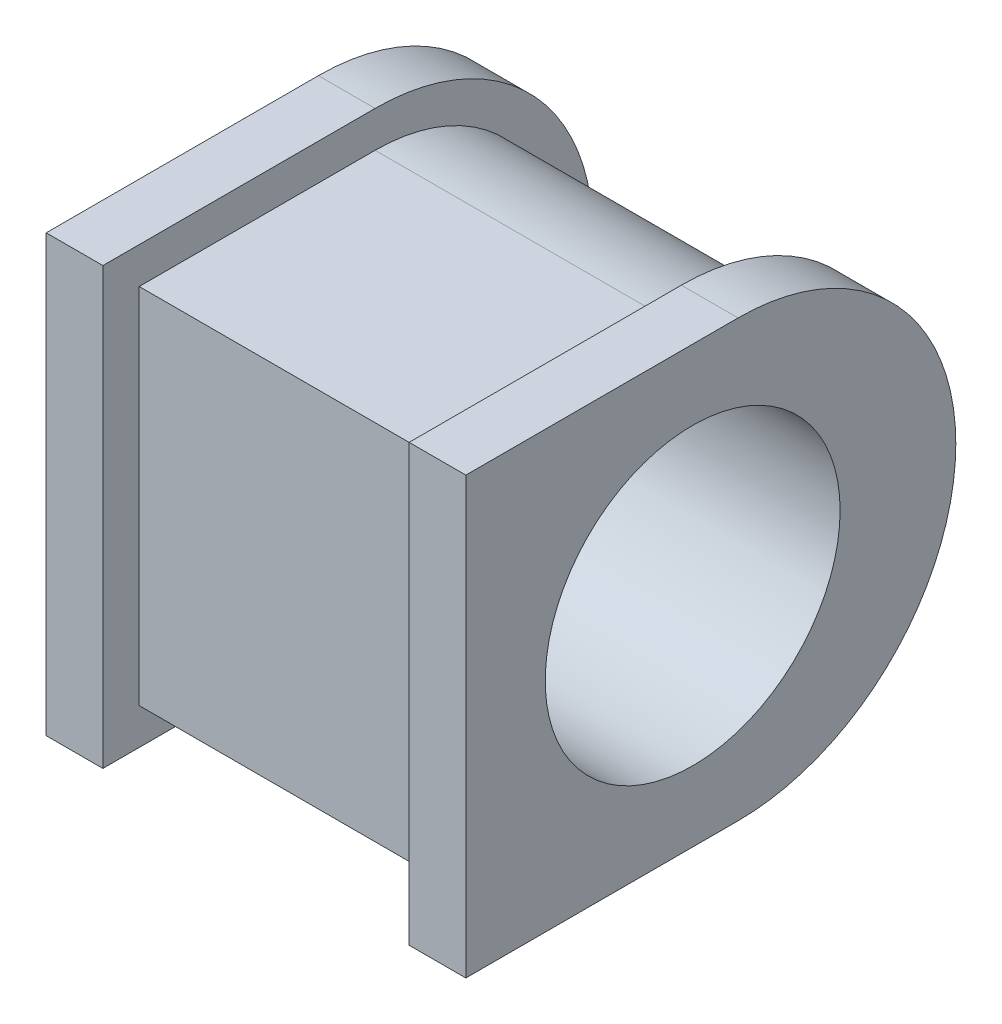
ISO-10303-21;
HEADER;
FILE_DESCRIPTION(('STEP AP214'),'2;1');
FILE_NAME('part.step','',(''),(''),'','','');
FILE_SCHEMA(('AUTOMOTIVE_DESIGN { 1 0 10303 214 1 1 1 1 }'));
ENDSEC;
DATA;
#1=APPLICATION_CONTEXT('core data for automotive mechanical design processes');
#2=APPLICATION_PROTOCOL_DEFINITION('international standard','automotive_design',2000,#1);
#3=PRODUCT_CONTEXT('',#1,'mechanical');
#4=PRODUCT('Part','Part','',(#3));
#5=PRODUCT_RELATED_PRODUCT_CATEGORY('part','',(#4));
#6=PRODUCT_DEFINITION_FORMATION('','',#4);
#7=PRODUCT_DEFINITION_CONTEXT('part definition',#1,'design');
#8=PRODUCT_DEFINITION('design','',#6,#7);
#9=PRODUCT_DEFINITION_SHAPE('','',#8);
#10=(LENGTH_UNIT() NAMED_UNIT(*) SI_UNIT(.MILLI.,.METRE.));
#11=(NAMED_UNIT(*) PLANE_ANGLE_UNIT() SI_UNIT($,.RADIAN.));
#12=(NAMED_UNIT(*) SI_UNIT($,.STERADIAN.) SOLID_ANGLE_UNIT());
#13=UNCERTAINTY_MEASURE_WITH_UNIT(LENGTH_MEASURE(1.E-05),#10,'distance_accuracy_value','');
#14=(GEOMETRIC_REPRESENTATION_CONTEXT(3) GLOBAL_UNCERTAINTY_ASSIGNED_CONTEXT((#13)) GLOBAL_UNIT_ASSIGNED_CONTEXT((#10,
#11,#12)) REPRESENTATION_CONTEXT('',''));
#15=CARTESIAN_POINT('',(0.,0.,0.));
#16=DIRECTION('',(0.,0.,1.));
#17=DIRECTION('',(1.,0.,0.));
#18=AXIS2_PLACEMENT_3D('',#15,#16,#17);
#19=CARTESIAN_POINT('',(80.,0.,0.));
#20=DIRECTION('',(0.,0.,-1.));
#21=DIRECTION('',(-1.,0.,0.));
#22=AXIS2_PLACEMENT_3D('',#19,#20,#21);
#23=PLANE('',#22);
#24=DIRECTION('',(0.,1.,0.));
#25=VECTOR('',#24,1.);
#26=CARTESIAN_POINT('',(12.5,0.,0.));
#27=LINE('',#26,#25);
#28=CARTESIAN_POINT('',(12.5,0.,0.));
#29=VERTEX_POINT('',#28);
#30=CARTESIAN_POINT('',(12.5,80.,0.));
#31=VERTEX_POINT('',#30);
#32=EDGE_CURVE('E51',#29,#31,#27,.T.);
#33=ORIENTED_EDGE('',*,*,#32,.F.);
#34=DIRECTION('',(-1.,0.,0.));
#35=VECTOR('',#34,1.);
#36=CARTESIAN_POINT('',(80.,0.,0.));
#37=LINE('',#36,#35);
#38=CARTESIAN_POINT('',(80.,0.,0.));
#39=VERTEX_POINT('',#38);
#40=EDGE_CURVE('E44',#39,#29,#37,.T.);
#41=ORIENTED_EDGE('',*,*,#40,.F.);
#42=DIRECTION('',(0.,-1.,0.));
#43=VECTOR('',#42,1.);
#44=CARTESIAN_POINT('',(80.,0.,0.));
#45=LINE('',#44,#43);
#46=CARTESIAN_POINT('',(80.,80.,0.));
#47=VERTEX_POINT('',#46);
#48=EDGE_CURVE('E206',#47,#39,#45,.T.);
#49=ORIENTED_EDGE('',*,*,#48,.F.);
#50=DIRECTION('',(-1.,0.,0.));
#51=VECTOR('',#50,1.);
#52=CARTESIAN_POINT('',(80.,80.,0.));
#53=LINE('',#52,#51);
#54=EDGE_CURVE('E218',#47,#31,#53,.T.);
#55=ORIENTED_EDGE('',*,*,#54,.T.);
#56=EDGE_LOOP('',(#33,#41,#49,#55));
#57=FACE_BOUND('',#56,.T.);
#58=ADVANCED_FACE('F37',(#57),#23,.F.);
#59=CARTESIAN_POINT('',(80.,0.,0.));
#60=DIRECTION('',(0.,1.,0.));
#61=DIRECTION('',(0.,0.,1.));
#62=AXIS2_PLACEMENT_3D('',#59,#60,#61);
#63=PLANE('',#62);
#64=DIRECTION('',(0.,0.,1.));
#65=VECTOR('',#64,1.);
#66=CARTESIAN_POINT('',(12.5,0.,0.));
#67=LINE('',#66,#65);
#68=CARTESIAN_POINT('',(12.5,0.,-52.));
#69=VERTEX_POINT('',#68);
#70=EDGE_CURVE('E58',#69,#29,#67,.T.);
#71=ORIENTED_EDGE('',*,*,#70,.F.);
#72=DIRECTION('',(-1.,0.,0.));
#73=VECTOR('',#72,1.);
#74=CARTESIAN_POINT('',(80.,0.,-52.));
#75=LINE('',#74,#73);
#76=CARTESIAN_POINT('',(80.,0.,-52.));
#77=VERTEX_POINT('',#76);
#78=EDGE_CURVE('E222',#77,#69,#75,.T.);
#79=ORIENTED_EDGE('',*,*,#78,.F.);
#80=DIRECTION('',(0.,0.,-1.));
#81=VECTOR('',#80,1.);
#82=CARTESIAN_POINT('',(80.,0.,0.));
#83=LINE('',#82,#81);
#84=EDGE_CURVE('E209',#39,#77,#83,.T.);
#85=ORIENTED_EDGE('',*,*,#84,.F.);
#86=ORIENTED_EDGE('',*,*,#40,.T.);
#87=EDGE_LOOP('',(#71,#79,#85,#86));
#88=FACE_BOUND('',#87,.T.);
#89=ADVANCED_FACE('F223',(#88),#63,.F.);
#90=CARTESIAN_POINT('',(80.,40.,-52.));
#91=DIRECTION('',(-1.,0.,0.));
#92=DIRECTION('',(0.,0.,1.));
#93=AXIS2_PLACEMENT_3D('',#90,#91,#92);
#94=CYLINDRICAL_SURFACE('',#93,40.);
#95=CARTESIAN_POINT('',(12.5,40.,-52.));
#96=DIRECTION('',(-1.,0.,0.));
#97=DIRECTION('',(0.,0.,1.));
#98=AXIS2_PLACEMENT_3D('',#95,#96,#97);
#99=CIRCLE('',#98,40.);
#100=CARTESIAN_POINT('',(12.5,80.,-52.));
#101=VERTEX_POINT('',#100);
#102=EDGE_CURVE('E138',#101,#69,#99,.T.);
#103=ORIENTED_EDGE('',*,*,#102,.F.);
#104=DIRECTION('',(-1.,0.,0.));
#105=VECTOR('',#104,1.);
#106=CARTESIAN_POINT('',(80.,80.,-52.));
#107=LINE('',#106,#105);
#108=CARTESIAN_POINT('',(80.,80.,-52.));
#109=VERTEX_POINT('',#108);
#110=EDGE_CURVE('E220',#109,#101,#107,.T.);
#111=ORIENTED_EDGE('',*,*,#110,.F.);
#112=CARTESIAN_POINT('',(80.,40.,-52.));
#113=DIRECTION('',(1.,0.,0.));
#114=DIRECTION('',(0.,0.,-1.));
#115=AXIS2_PLACEMENT_3D('',#112,#113,#114);
#116=CIRCLE('',#115,40.);
#117=EDGE_CURVE('E212',#77,#109,#116,.T.);
#118=ORIENTED_EDGE('',*,*,#117,.F.);
#119=ORIENTED_EDGE('',*,*,#78,.T.);
#120=EDGE_LOOP('',(#103,#111,#118,#119));
#121=FACE_BOUND('',#120,.T.);
#122=ADVANCED_FACE('F228',(#121),#94,.T.);
#123=CARTESIAN_POINT('',(80.,80.,0.));
#124=DIRECTION('',(0.,-1.,0.));
#125=DIRECTION('',(0.,0.,-1.));
#126=AXIS2_PLACEMENT_3D('',#123,#124,#125);
#127=PLANE('',#126);
#128=DIRECTION('',(0.,0.,-1.));
#129=VECTOR('',#128,1.);
#130=CARTESIAN_POINT('',(12.5,80.,0.));
#131=LINE('',#130,#129);
#132=EDGE_CURVE('E11',#31,#101,#131,.T.);
#133=ORIENTED_EDGE('',*,*,#132,.F.);
#134=ORIENTED_EDGE('',*,*,#54,.F.);
#135=DIRECTION('',(0.,0.,1.));
#136=VECTOR('',#135,1.);
#137=CARTESIAN_POINT('',(80.,80.,0.));
#138=LINE('',#137,#136);
#139=EDGE_CURVE('E215',#109,#47,#138,.T.);
#140=ORIENTED_EDGE('',*,*,#139,.F.);
#141=ORIENTED_EDGE('',*,*,#110,.T.);
#142=EDGE_LOOP('',(#133,#134,#140,#141));
#143=FACE_BOUND('',#142,.T.);
#144=ADVANCED_FACE('F235',(#143),#127,.F.);
#145=CARTESIAN_POINT('',(80.,40.,-52.));
#146=DIRECTION('',(1.,0.,0.));
#147=DIRECTION('',(0.,0.,-1.));
#148=AXIS2_PLACEMENT_3D('',#145,#146,#147);
#149=PLANE('',#148);
#150=DIRECTION('',(0.,0.,-1.));
#151=VECTOR('',#150,1.);
#152=CARTESIAN_POINT('',(80.,-8.,8.));
#153=LINE('',#152,#151);
#154=CARTESIAN_POINT('',(80.,-8.,8.));
#155=VERTEX_POINT('',#154);
#156=CARTESIAN_POINT('',(80.,-8.,-52.));
#157=VERTEX_POINT('',#156);
#158=EDGE_CURVE('E176',#155,#157,#153,.T.);
#159=ORIENTED_EDGE('',*,*,#158,.F.);
#160=DIRECTION('',(0.,-1.,0.));
#161=VECTOR('',#160,1.);
#162=CARTESIAN_POINT('',(80.,88.,8.00000000000001));
#163=LINE('',#162,#161);
#164=CARTESIAN_POINT('',(80.,88.,8.00000000000001));
#165=VERTEX_POINT('',#164);
#166=EDGE_CURVE('E181',#165,#155,#163,.T.);
#167=ORIENTED_EDGE('',*,*,#166,.F.);
#168=DIRECTION('',(0.,0.,1.));
#169=VECTOR('',#168,1.);
#170=CARTESIAN_POINT('',(80.,88.,8.00000000000001));
#171=LINE('',#170,#169);
#172=CARTESIAN_POINT('',(80.,88.,-52.));
#173=VERTEX_POINT('',#172);
#174=EDGE_CURVE('E192',#173,#165,#171,.T.);
#175=ORIENTED_EDGE('',*,*,#174,.F.);
#176=CARTESIAN_POINT('',(80.,40.,-52.));
#177=DIRECTION('',(1.,0.,0.));
#178=DIRECTION('',(0.,0.,-1.));
#179=AXIS2_PLACEMENT_3D('',#176,#177,#178);
#180=CIRCLE('',#179,48.);
#181=EDGE_CURVE('E190',#157,#173,#180,.T.);
#182=ORIENTED_EDGE('',*,*,#181,.F.);
#183=EDGE_LOOP('',(#159,#167,#175,#182));
#184=FACE_BOUND('',#183,.T.);
#185=ORIENTED_EDGE('',*,*,#139,.T.);
#186=ORIENTED_EDGE('',*,*,#48,.T.);
#187=ORIENTED_EDGE('',*,*,#84,.T.);
#188=ORIENTED_EDGE('',*,*,#117,.T.);
#189=EDGE_LOOP('',(#185,#186,#187,#188));
#190=FACE_BOUND('',#189,.T.);
#191=ADVANCED_FACE('F232',(#184,#190),#149,.F.);
#192=CARTESIAN_POINT('',(92.5,-8.,8.));
#193=DIRECTION('',(0.,1.,0.));
#194=DIRECTION('',(0.,0.,1.));
#195=AXIS2_PLACEMENT_3D('',#192,#193,#194);
#196=PLANE('',#195);
#197=ORIENTED_EDGE('',*,*,#158,.T.);
#198=DIRECTION('',(-1.,0.,0.));
#199=VECTOR('',#198,1.);
#200=CARTESIAN_POINT('',(92.5,-8.,-52.));
#201=LINE('',#200,#199);
#202=CARTESIAN_POINT('',(92.5,-8.,-52.));
#203=VERTEX_POINT('',#202);
#204=EDGE_CURVE('E203',#203,#157,#201,.T.);
#205=ORIENTED_EDGE('',*,*,#204,.F.);
#206=DIRECTION('',(0.,0.,-1.));
#207=VECTOR('',#206,1.);
#208=CARTESIAN_POINT('',(92.5,-8.,8.));
#209=LINE('',#208,#207);
#210=CARTESIAN_POINT('',(92.5,-8.,8.));
#211=VERTEX_POINT('',#210);
#212=EDGE_CURVE('E177',#211,#203,#209,.T.);
#213=ORIENTED_EDGE('',*,*,#212,.F.);
#214=DIRECTION('',(-1.,0.,0.));
#215=VECTOR('',#214,1.);
#216=CARTESIAN_POINT('',(92.5,-8.,8.));
#217=LINE('',#216,#215);
#218=EDGE_CURVE('E187',#211,#155,#217,.T.);
#219=ORIENTED_EDGE('',*,*,#218,.T.);
#220=EDGE_LOOP('',(#197,#205,#213,#219));
#221=FACE_BOUND('',#220,.T.);
#222=ADVANCED_FACE('F242',(#221),#196,.F.);
#223=CARTESIAN_POINT('',(92.5,40.,-52.));
#224=DIRECTION('',(-1.,0.,0.));
#225=DIRECTION('',(0.,0.,1.));
#226=AXIS2_PLACEMENT_3D('',#223,#224,#225);
#227=CYLINDRICAL_SURFACE('',#226,48.);
#228=ORIENTED_EDGE('',*,*,#181,.T.);
#229=DIRECTION('',(-1.,0.,0.));
#230=VECTOR('',#229,1.);
#231=CARTESIAN_POINT('',(92.5,88.,-52.));
#232=LINE('',#231,#230);
#233=CARTESIAN_POINT('',(92.5,88.,-52.));
#234=VERTEX_POINT('',#233);
#235=EDGE_CURVE('E200',#234,#173,#232,.T.);
#236=ORIENTED_EDGE('',*,*,#235,.F.);
#237=CARTESIAN_POINT('',(92.5,40.,-52.));
#238=DIRECTION('',(1.,0.,0.));
#239=DIRECTION('',(0.,0.,-1.));
#240=AXIS2_PLACEMENT_3D('',#237,#238,#239);
#241=CIRCLE('',#240,48.);
#242=EDGE_CURVE('E180',#203,#234,#241,.T.);
#243=ORIENTED_EDGE('',*,*,#242,.F.);
#244=ORIENTED_EDGE('',*,*,#204,.T.);
#245=EDGE_LOOP('',(#228,#236,#243,#244));
#246=FACE_BOUND('',#245,.T.);
#247=ADVANCED_FACE('F383',(#246),#227,.T.);
#248=CARTESIAN_POINT('',(92.5,88.,8.00000000000001));
#249=DIRECTION('',(0.,-1.,0.));
#250=DIRECTION('',(0.,0.,-1.));
#251=AXIS2_PLACEMENT_3D('',#248,#249,#250);
#252=PLANE('',#251);
#253=ORIENTED_EDGE('',*,*,#174,.T.);
#254=DIRECTION('',(-1.,0.,0.));
#255=VECTOR('',#254,1.);
#256=CARTESIAN_POINT('',(92.5,88.,8.00000000000001));
#257=LINE('',#256,#255);
#258=CARTESIAN_POINT('',(92.5,88.,8.00000000000001));
#259=VERTEX_POINT('',#258);
#260=EDGE_CURVE('E197',#259,#165,#257,.T.);
#261=ORIENTED_EDGE('',*,*,#260,.F.);
#262=DIRECTION('',(0.,0.,1.));
#263=VECTOR('',#262,1.);
#264=CARTESIAN_POINT('',(92.5,88.,8.00000000000001));
#265=LINE('',#264,#263);
#266=EDGE_CURVE('E183',#234,#259,#265,.T.);
#267=ORIENTED_EDGE('',*,*,#266,.F.);
#268=ORIENTED_EDGE('',*,*,#235,.T.);
#269=EDGE_LOOP('',(#253,#261,#267,#268));
#270=FACE_BOUND('',#269,.T.);
#271=ADVANCED_FACE('F372',(#270),#252,.F.);
#272=CARTESIAN_POINT('',(92.5,88.,8.00000000000001));
#273=DIRECTION('',(0.,0.,-1.));
#274=DIRECTION('',(0.,1.,0.));
#275=AXIS2_PLACEMENT_3D('',#272,#273,#274);
#276=PLANE('',#275);
#277=ORIENTED_EDGE('',*,*,#166,.T.);
#278=ORIENTED_EDGE('',*,*,#218,.F.);
#279=DIRECTION('',(0.,-1.,0.));
#280=VECTOR('',#279,1.);
#281=CARTESIAN_POINT('',(92.5,88.,8.00000000000001));
#282=LINE('',#281,#280);
#283=EDGE_CURVE('E185',#259,#211,#282,.T.);
#284=ORIENTED_EDGE('',*,*,#283,.F.);
#285=ORIENTED_EDGE('',*,*,#260,.T.);
#286=EDGE_LOOP('',(#277,#278,#284,#285));
#287=FACE_BOUND('',#286,.T.);
#288=ADVANCED_FACE('F325',(#287),#276,.F.);
#289=CARTESIAN_POINT('',(92.5,40.,-52.));
#290=DIRECTION('',(1.,0.,0.));
#291=DIRECTION('',(0.,0.,-1.));
#292=AXIS2_PLACEMENT_3D('',#289,#290,#291);
#293=PLANE('',#292);
#294=CARTESIAN_POINT('',(92.5,40.,-42.));
#295=DIRECTION('',(1.,0.,0.));
#296=DIRECTION('',(0.,0.,-1.));
#297=AXIS2_PLACEMENT_3D('',#294,#295,#296);
#298=CIRCLE('',#297,32.5);
#299=CARTESIAN_POINT('',(92.5,40.,-74.5));
#300=VERTEX_POINT('',#299);
#301=EDGE_CURVE('E440',#300,#300,#298,.T.);
#302=ORIENTED_EDGE('',*,*,#301,.F.);
#303=EDGE_LOOP('',(#302));
#304=FACE_BOUND('',#303,.T.);
#305=ORIENTED_EDGE('',*,*,#212,.T.);
#306=ORIENTED_EDGE('',*,*,#242,.T.);
#307=ORIENTED_EDGE('',*,*,#266,.T.);
#308=ORIENTED_EDGE('',*,*,#283,.T.);
#309=EDGE_LOOP('',(#305,#306,#307,#308));
#310=FACE_BOUND('',#309,.T.);
#311=ADVANCED_FACE('F271',(#304,#310),#293,.T.);
#312=CARTESIAN_POINT('',(12.5,40.,-52.));
#313=DIRECTION('',(-1.,0.,0.));
#314=DIRECTION('',(0.,0.,-1.));
#315=AXIS2_PLACEMENT_3D('',#312,#313,#314);
#316=PLANE('',#315);
#317=DIRECTION('',(0.,0.,-1.));
#318=VECTOR('',#317,1.);
#319=CARTESIAN_POINT('',(12.5,-8.,8.));
#320=LINE('',#319,#318);
#321=CARTESIAN_POINT('',(12.5,-8.,8.));
#322=VERTEX_POINT('',#321);
#323=CARTESIAN_POINT('',(12.5,-8.,-52.));
#324=VERTEX_POINT('',#323);
#325=EDGE_CURVE('E133',#322,#324,#320,.T.);
#326=ORIENTED_EDGE('',*,*,#325,.T.);
#327=CARTESIAN_POINT('',(12.5,40.,-52.));
#328=DIRECTION('',(1.,0.,0.));
#329=DIRECTION('',(0.,0.,-1.));
#330=AXIS2_PLACEMENT_3D('',#327,#328,#329);
#331=CIRCLE('',#330,48.);
#332=CARTESIAN_POINT('',(12.5,88.,-52.));
#333=VERTEX_POINT('',#332);
#334=EDGE_CURVE('E149',#324,#333,#331,.T.);
#335=ORIENTED_EDGE('',*,*,#334,.T.);
#336=DIRECTION('',(0.,0.,1.));
#337=VECTOR('',#336,1.);
#338=CARTESIAN_POINT('',(12.5,88.,8.00000000000001));
#339=LINE('',#338,#337);
#340=CARTESIAN_POINT('',(12.5,88.,8.00000000000001));
#341=VERTEX_POINT('',#340);
#342=EDGE_CURVE('E163',#333,#341,#339,.T.);
#343=ORIENTED_EDGE('',*,*,#342,.T.);
#344=DIRECTION('',(0.,-1.,0.));
#345=VECTOR('',#344,1.);
#346=CARTESIAN_POINT('',(12.5,88.,8.00000000000001));
#347=LINE('',#346,#345);
#348=EDGE_CURVE('E160',#341,#322,#347,.T.);
#349=ORIENTED_EDGE('',*,*,#348,.T.);
#350=EDGE_LOOP('',(#326,#335,#343,#349));
#351=FACE_BOUND('',#350,.T.);
#352=ORIENTED_EDGE('',*,*,#70,.T.);
#353=ORIENTED_EDGE('',*,*,#32,.T.);
#354=ORIENTED_EDGE('',*,*,#132,.T.);
#355=ORIENTED_EDGE('',*,*,#102,.T.);
#356=EDGE_LOOP('',(#352,#353,#354,#355));
#357=FACE_BOUND('',#356,.T.);
#358=ADVANCED_FACE('F225',(#351,#357),#316,.F.);
#359=CARTESIAN_POINT('',(0.,-8.,8.));
#360=DIRECTION('',(0.,-1.,0.));
#361=DIRECTION('',(0.,0.,-1.));
#362=AXIS2_PLACEMENT_3D('',#359,#360,#361);
#363=PLANE('',#362);
#364=ORIENTED_EDGE('',*,*,#325,.F.);
#365=DIRECTION('',(1.,0.,0.));
#366=VECTOR('',#365,1.);
#367=CARTESIAN_POINT('',(0.,-8.,8.));
#368=LINE('',#367,#366);
#369=CARTESIAN_POINT('',(0.,-8.,8.));
#370=VERTEX_POINT('',#369);
#371=EDGE_CURVE('E127',#370,#322,#368,.T.);
#372=ORIENTED_EDGE('',*,*,#371,.F.);
#373=DIRECTION('',(0.,0.,-1.));
#374=VECTOR('',#373,1.);
#375=CARTESIAN_POINT('',(0.,-8.,8.));
#376=LINE('',#375,#374);
#377=CARTESIAN_POINT('',(0.,-8.,-52.));
#378=VERTEX_POINT('',#377);
#379=EDGE_CURVE('E130',#370,#378,#376,.T.);
#380=ORIENTED_EDGE('',*,*,#379,.T.);
#381=DIRECTION('',(1.,0.,0.));
#382=VECTOR('',#381,1.);
#383=CARTESIAN_POINT('',(0.,-8.,-52.));
#384=LINE('',#383,#382);
#385=EDGE_CURVE('E158',#378,#324,#384,.T.);
#386=ORIENTED_EDGE('',*,*,#385,.T.);
#387=EDGE_LOOP('',(#364,#372,#380,#386));
#388=FACE_BOUND('',#387,.T.);
#389=ADVANCED_FACE('F129',(#388),#363,.T.);
#390=CARTESIAN_POINT('',(0.,88.,8.00000000000001));
#391=DIRECTION('',(0.,0.,1.));
#392=DIRECTION('',(0.,-1.,0.));
#393=AXIS2_PLACEMENT_3D('',#390,#391,#392);
#394=PLANE('',#393);
#395=ORIENTED_EDGE('',*,*,#348,.F.);
#396=DIRECTION('',(1.,0.,0.));
#397=VECTOR('',#396,1.);
#398=CARTESIAN_POINT('',(0.,88.,8.00000000000001));
#399=LINE('',#398,#397);
#400=CARTESIAN_POINT('',(0.,88.,8.00000000000001));
#401=VERTEX_POINT('',#400);
#402=EDGE_CURVE('E139',#401,#341,#399,.T.);
#403=ORIENTED_EDGE('',*,*,#402,.F.);
#404=DIRECTION('',(0.,-1.,0.));
#405=VECTOR('',#404,1.);
#406=CARTESIAN_POINT('',(0.,88.,8.00000000000001));
#407=LINE('',#406,#405);
#408=EDGE_CURVE('E145',#401,#370,#407,.T.);
#409=ORIENTED_EDGE('',*,*,#408,.T.);
#410=ORIENTED_EDGE('',*,*,#371,.T.);
#411=EDGE_LOOP('',(#395,#403,#409,#410));
#412=FACE_BOUND('',#411,.T.);
#413=ADVANCED_FACE('F151',(#412),#394,.T.);
#414=CARTESIAN_POINT('',(0.,88.,8.00000000000001));
#415=DIRECTION('',(0.,1.,0.));
#416=DIRECTION('',(0.,0.,1.));
#417=AXIS2_PLACEMENT_3D('',#414,#415,#416);
#418=PLANE('',#417);
#419=ORIENTED_EDGE('',*,*,#342,.F.);
#420=DIRECTION('',(1.,0.,0.));
#421=VECTOR('',#420,1.);
#422=CARTESIAN_POINT('',(0.,88.,-52.));
#423=LINE('',#422,#421);
#424=CARTESIAN_POINT('',(0.,88.,-52.));
#425=VERTEX_POINT('',#424);
#426=EDGE_CURVE('E169',#425,#333,#423,.T.);
#427=ORIENTED_EDGE('',*,*,#426,.F.);
#428=DIRECTION('',(0.,0.,1.));
#429=VECTOR('',#428,1.);
#430=CARTESIAN_POINT('',(0.,88.,8.00000000000001));
#431=LINE('',#430,#429);
#432=EDGE_CURVE('E152',#425,#401,#431,.T.);
#433=ORIENTED_EDGE('',*,*,#432,.T.);
#434=ORIENTED_EDGE('',*,*,#402,.T.);
#435=EDGE_LOOP('',(#419,#427,#433,#434));
#436=FACE_BOUND('',#435,.T.);
#437=ADVANCED_FACE('F293',(#436),#418,.T.);
#438=CARTESIAN_POINT('',(0.,40.,-52.));
#439=DIRECTION('',(1.,0.,0.));
#440=DIRECTION('',(0.,0.,-1.));
#441=AXIS2_PLACEMENT_3D('',#438,#439,#440);
#442=CYLINDRICAL_SURFACE('',#441,48.);
#443=ORIENTED_EDGE('',*,*,#334,.F.);
#444=ORIENTED_EDGE('',*,*,#385,.F.);
#445=CARTESIAN_POINT('',(0.,40.,-52.));
#446=DIRECTION('',(1.,0.,0.));
#447=DIRECTION('',(0.,0.,-1.));
#448=AXIS2_PLACEMENT_3D('',#445,#446,#447);
#449=CIRCLE('',#448,48.);
#450=EDGE_CURVE('E148',#378,#425,#449,.T.);
#451=ORIENTED_EDGE('',*,*,#450,.T.);
#452=ORIENTED_EDGE('',*,*,#426,.T.);
#453=EDGE_LOOP('',(#443,#444,#451,#452));
#454=FACE_BOUND('',#453,.T.);
#455=ADVANCED_FACE('F303',(#454),#442,.T.);
#456=CARTESIAN_POINT('',(0.,40.,-52.));
#457=DIRECTION('',(1.,0.,0.));
#458=DIRECTION('',(0.,0.,-1.));
#459=AXIS2_PLACEMENT_3D('',#456,#457,#458);
#460=PLANE('',#459);
#461=CARTESIAN_POINT('',(0.,40.,-42.));
#462=DIRECTION('',(1.,0.,0.));
#463=DIRECTION('',(0.,0.,-1.));
#464=AXIS2_PLACEMENT_3D('',#461,#462,#463);
#465=CIRCLE('',#464,32.5);
#466=CARTESIAN_POINT('',(0.,40.,-74.5));
#467=VERTEX_POINT('',#466);
#468=EDGE_CURVE('E161',#467,#467,#465,.F.);
#469=ORIENTED_EDGE('',*,*,#468,.F.);
#470=EDGE_LOOP('',(#469));
#471=FACE_BOUND('',#470,.T.);
#472=ORIENTED_EDGE('',*,*,#379,.F.);
#473=ORIENTED_EDGE('',*,*,#408,.F.);
#474=ORIENTED_EDGE('',*,*,#432,.F.);
#475=ORIENTED_EDGE('',*,*,#450,.F.);
#476=EDGE_LOOP('',(#472,#473,#474,#475));
#477=FACE_BOUND('',#476,.T.);
#478=ADVANCED_FACE('F143',(#471,#477),#460,.F.);
#479=CARTESIAN_POINT('',(-0.001000000000001,40.,-42.));
#480=DIRECTION('',(1.,0.,0.));
#481=DIRECTION('',(0.,0.,-1.));
#482=AXIS2_PLACEMENT_3D('',#479,#480,#481);
#483=CYLINDRICAL_SURFACE('',#482,32.5);
#484=ORIENTED_EDGE('',*,*,#301,.T.);
#485=EDGE_LOOP('',(#484));
#486=FACE_BOUND('',#485,.T.);
#487=ORIENTED_EDGE('',*,*,#468,.T.);
#488=EDGE_LOOP('',(#487));
#489=FACE_BOUND('',#488,.T.);
#490=ADVANCED_FACE('F335',(#486,#489),#483,.F.);
#491=CLOSED_SHELL('',(#58,#89,#122,#144,#191,#222,#247,#271,#288,#311,#358,#389,#413,#437,#455,
#478,#490));
#492=MANIFOLD_SOLID_BREP('B2',#491);
#493=ADVANCED_BREP_SHAPE_REPRESENTATION('',(#18,#492),#14);
#494=SHAPE_DEFINITION_REPRESENTATION(#9,#493);
ENDSEC;
END-ISO-10303-21;
